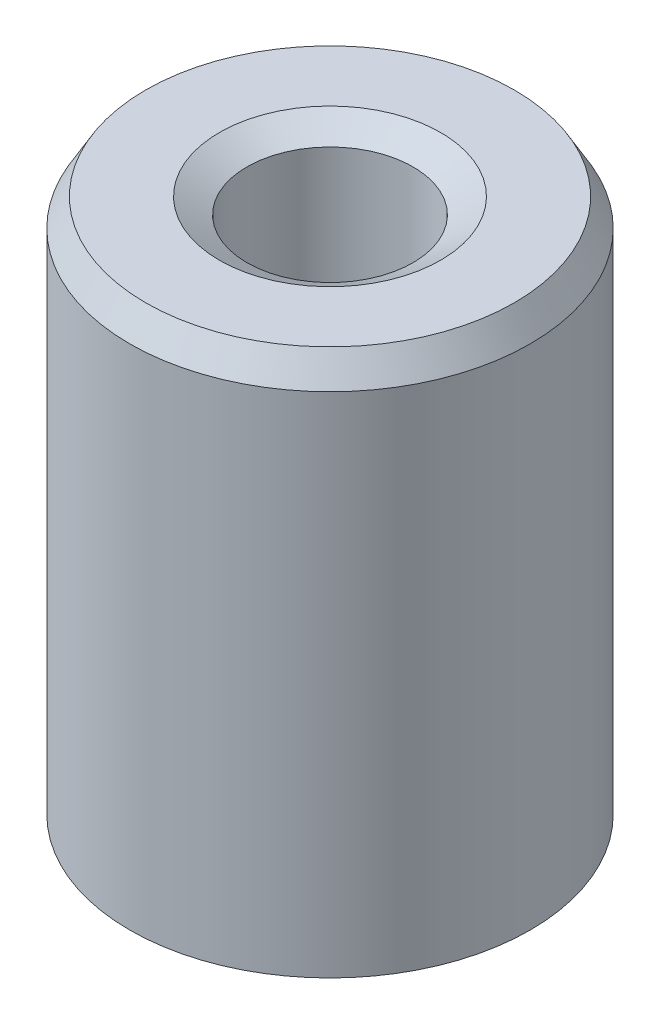
ISO-10303-21;
HEADER;
FILE_DESCRIPTION(('STEP AP214'),'2;1');
FILE_NAME('part.step','',(''),(''),'','','');
FILE_SCHEMA(('AUTOMOTIVE_DESIGN { 1 0 10303 214 1 1 1 1 }'));
ENDSEC;
DATA;
#1=APPLICATION_CONTEXT('core data for automotive mechanical design processes');
#2=APPLICATION_PROTOCOL_DEFINITION('international standard','automotive_design',2000,#1);
#3=PRODUCT_CONTEXT('',#1,'mechanical');
#4=PRODUCT('Part','Part','',(#3));
#5=PRODUCT_RELATED_PRODUCT_CATEGORY('part','',(#4));
#6=PRODUCT_DEFINITION_FORMATION('','',#4);
#7=PRODUCT_DEFINITION_CONTEXT('part definition',#1,'design');
#8=PRODUCT_DEFINITION('design','',#6,#7);
#9=PRODUCT_DEFINITION_SHAPE('','',#8);
#10=(LENGTH_UNIT() NAMED_UNIT(*) SI_UNIT(.MILLI.,.METRE.));
#11=(NAMED_UNIT(*) PLANE_ANGLE_UNIT() SI_UNIT($,.RADIAN.));
#12=(NAMED_UNIT(*) SI_UNIT($,.STERADIAN.) SOLID_ANGLE_UNIT());
#13=UNCERTAINTY_MEASURE_WITH_UNIT(LENGTH_MEASURE(1.E-05),#10,'distance_accuracy_value','');
#14=(GEOMETRIC_REPRESENTATION_CONTEXT(3) GLOBAL_UNCERTAINTY_ASSIGNED_CONTEXT((#13)) GLOBAL_UNIT_ASSIGNED_CONTEXT((#10,
#11,#12)) REPRESENTATION_CONTEXT('',''));
#15=CARTESIAN_POINT('',(0.,0.,0.));
#16=DIRECTION('',(0.,0.,1.));
#17=DIRECTION('',(1.,0.,0.));
#18=AXIS2_PLACEMENT_3D('',#15,#16,#17);
#19=CARTESIAN_POINT('',(0.,61.934558298846,0.));
#20=DIRECTION('',(0.,-1.,0.));
#21=DIRECTION('',(0.,0.,-1.));
#22=AXIS2_PLACEMENT_3D('',#19,#20,#21);
#23=CYLINDRICAL_SURFACE('',#22,22.5);
#24=CARTESIAN_POINT('',(0.,1.79041406598166,0.));
#25=DIRECTION('',(0.,1.,0.));
#26=DIRECTION('',(0.,0.,1.));
#27=AXIS2_PLACEMENT_3D('',#24,#25,#26);
#28=CIRCLE('',#27,22.5);
#29=CARTESIAN_POINT('',(0.,1.79041406598166,22.5));
#30=VERTEX_POINT('',#29);
#31=EDGE_CURVE('E10',#30,#30,#28,.T.);
#32=ORIENTED_EDGE('',*,*,#31,.T.);
#33=EDGE_LOOP('',(#32));
#34=FACE_BOUND('',#33,.T.);
#35=CARTESIAN_POINT('',(0.,58.8334701699797,0.));
#36=DIRECTION('',(0.,1.,0.));
#37=DIRECTION('',(0.,0.,1.));
#38=AXIS2_PLACEMENT_3D('',#35,#36,#37);
#39=CIRCLE('',#38,22.5);
#40=CARTESIAN_POINT('',(0.,58.8334701699797,-22.5));
#41=VERTEX_POINT('',#40);
#42=EDGE_CURVE('E50',#41,#41,#39,.F.);
#43=ORIENTED_EDGE('',*,*,#42,.T.);
#44=EDGE_LOOP('',(#43));
#45=FACE_BOUND('',#44,.T.);
#46=ADVANCED_FACE('F39',(#34,#45),#23,.T.);
#47=CARTESIAN_POINT('',(0.,61.934558298846,0.));
#48=DIRECTION('',(0.,1.,0.));
#49=DIRECTION('',(0.,0.,1.));
#50=AXIS2_PLACEMENT_3D('',#47,#48,#49);
#51=PLANE('',#50);
#52=CARTESIAN_POINT('',(0.,61.934558298846,0.));
#53=DIRECTION('',(0.,1.,0.));
#54=DIRECTION('',(0.,0.,1.));
#55=AXIS2_PLACEMENT_3D('',#52,#53,#54);
#56=CIRCLE('',#55,12.4328409515347);
#57=CARTESIAN_POINT('',(0.,61.934558298846,12.4328409515347));
#58=VERTEX_POINT('',#57);
#59=EDGE_CURVE('E58',#58,#58,#56,.F.);
#60=ORIENTED_EDGE('',*,*,#59,.T.);
#61=EDGE_LOOP('',(#60));
#62=FACE_BOUND('',#61,.T.);
#63=CARTESIAN_POINT('',(0.,61.934558298846,0.));
#64=DIRECTION('',(0.,1.,0.));
#65=DIRECTION('',(0.,0.,1.));
#66=AXIS2_PLACEMENT_3D('',#63,#64,#65);
#67=CIRCLE('',#66,20.7095859340183);
#68=CARTESIAN_POINT('',(0.,61.934558298846,-20.7095859340183));
#69=VERTEX_POINT('',#68);
#70=EDGE_CURVE('E61',#69,#69,#67,.T.);
#71=ORIENTED_EDGE('',*,*,#70,.T.);
#72=EDGE_LOOP('',(#71));
#73=FACE_BOUND('',#72,.T.);
#74=ADVANCED_FACE('F88',(#62,#73),#51,.T.);
#75=CARTESIAN_POINT('',(0.,0.,0.));
#76=DIRECTION('',(0.,1.,0.));
#77=DIRECTION('',(0.,0.,1.));
#78=AXIS2_PLACEMENT_3D('',#75,#76,#77);
#79=PLANE('',#78);
#80=CARTESIAN_POINT('',(0.,0.,0.));
#81=DIRECTION('',(0.,1.,0.));
#82=DIRECTION('',(0.,0.,1.));
#83=AXIS2_PLACEMENT_3D('',#80,#81,#82);
#84=CIRCLE('',#83,11.1221668886501);
#85=CARTESIAN_POINT('',(0.,0.,11.1221668886501));
#86=VERTEX_POINT('',#85);
#87=EDGE_CURVE('E51',#86,#86,#84,.T.);
#88=ORIENTED_EDGE('',*,*,#87,.T.);
#89=EDGE_LOOP('',(#88));
#90=FACE_BOUND('',#89,.T.);
#91=CARTESIAN_POINT('',(0.,0.,0.));
#92=DIRECTION('',(0.,1.,0.));
#93=DIRECTION('',(0.,0.,1.));
#94=AXIS2_PLACEMENT_3D('',#91,#92,#93);
#95=CIRCLE('',#94,19.3989118711337);
#96=CARTESIAN_POINT('',(0.,0.,19.3989118711337));
#97=VERTEX_POINT('',#96);
#98=EDGE_CURVE('E54',#97,#97,#95,.F.);
#99=ORIENTED_EDGE('',*,*,#98,.T.);
#100=EDGE_LOOP('',(#99));
#101=FACE_BOUND('',#100,.T.);
#102=ADVANCED_FACE('F83',(#90,#101),#79,.F.);
#103=CARTESIAN_POINT('',(0.,61.934558298846,0.));
#104=DIRECTION('',(0.,-1.,0.));
#105=DIRECTION('',(0.,0.,-1.));
#106=AXIS2_PLACEMENT_3D('',#103,#104,#105);
#107=CYLINDRICAL_SURFACE('',#106,9.33175282266846);
#108=CARTESIAN_POINT('',(0.,60.1441442328643,0.));
#109=DIRECTION('',(0.,1.,0.));
#110=DIRECTION('',(0.,0.,1.));
#111=AXIS2_PLACEMENT_3D('',#108,#109,#110);
#112=CIRCLE('',#111,9.33175282266846);
#113=CARTESIAN_POINT('',(0.,60.1441442328643,9.33175282266846));
#114=VERTEX_POINT('',#113);
#115=EDGE_CURVE('E67',#114,#114,#112,.T.);
#116=ORIENTED_EDGE('',*,*,#115,.T.);
#117=EDGE_LOOP('',(#116));
#118=FACE_BOUND('',#117,.T.);
#119=CARTESIAN_POINT('',(0.,3.1010881288662,0.));
#120=DIRECTION('',(0.,1.,0.));
#121=DIRECTION('',(0.,0.,1.));
#122=AXIS2_PLACEMENT_3D('',#119,#120,#121);
#123=CIRCLE('',#122,9.33175282266846);
#124=CARTESIAN_POINT('',(0.,3.1010881288662,9.33175282266846));
#125=VERTEX_POINT('',#124);
#126=EDGE_CURVE('E69',#125,#125,#123,.F.);
#127=ORIENTED_EDGE('',*,*,#126,.T.);
#128=EDGE_LOOP('',(#127));
#129=FACE_BOUND('',#128,.T.);
#130=ADVANCED_FACE('F71',(#118,#129),#107,.F.);
#131=CARTESIAN_POINT('',(0.,60.1441442328643,0.));
#132=DIRECTION('',(0.,1.,0.));
#133=DIRECTION('',(0.,0.,1.));
#134=AXIS2_PLACEMENT_3D('',#131,#132,#133);
#135=CONICAL_SURFACE('',#134,9.33175282266846,1.0471975511966);
#136=ORIENTED_EDGE('',*,*,#59,.F.);
#137=EDGE_LOOP('',(#136));
#138=FACE_BOUND('',#137,.T.);
#139=ORIENTED_EDGE('',*,*,#115,.F.);
#140=EDGE_LOOP('',(#139));
#141=FACE_BOUND('',#140,.T.);
#142=ADVANCED_FACE('F77',(#138,#141),#135,.F.);
#143=CARTESIAN_POINT('',(0.,0.,0.));
#144=DIRECTION('',(0.,-1.,0.));
#145=DIRECTION('',(0.,0.,-1.));
#146=AXIS2_PLACEMENT_3D('',#143,#144,#145);
#147=CONICAL_SURFACE('',#146,11.1221668886501,0.523598775598296);
#148=ORIENTED_EDGE('',*,*,#126,.F.);
#149=EDGE_LOOP('',(#148));
#150=FACE_BOUND('',#149,.T.);
#151=ORIENTED_EDGE('',*,*,#87,.F.);
#152=EDGE_LOOP('',(#151));
#153=FACE_BOUND('',#152,.T.);
#154=ADVANCED_FACE('F73',(#150,#153),#147,.F.);
#155=CARTESIAN_POINT('',(0.,1.79041406598166,0.));
#156=DIRECTION('',(0.,1.,0.));
#157=DIRECTION('',(0.,0.,1.));
#158=AXIS2_PLACEMENT_3D('',#155,#156,#157);
#159=CONICAL_SURFACE('',#158,22.5,1.0471975511966);
#160=ORIENTED_EDGE('',*,*,#98,.F.);
#161=EDGE_LOOP('',(#160));
#162=FACE_BOUND('',#161,.T.);
#163=ORIENTED_EDGE('',*,*,#31,.F.);
#164=EDGE_LOOP('',(#163));
#165=FACE_BOUND('',#164,.T.);
#166=ADVANCED_FACE('F76',(#162,#165),#159,.T.);
#167=CARTESIAN_POINT('',(0.,61.934558298846,0.));
#168=DIRECTION('',(0.,-1.,0.));
#169=DIRECTION('',(0.,0.,-1.));
#170=AXIS2_PLACEMENT_3D('',#167,#168,#169);
#171=CONICAL_SURFACE('',#170,20.7095859340183,0.523598775598295);
#172=CARTESIAN_POINT('',(0.,58.8334701699797,-22.5));
#173=CARTESIAN_POINT('',(0.,58.8657731713221,-22.4813498534794));
#174=CARTESIAN_POINT('',(0.,58.8980761726644,-22.4626997069587));
#175=CARTESIAN_POINT('',(0.,58.9626821753491,-22.4253994139174));
#176=CARTESIAN_POINT('',(0.,58.9949851766915,-22.4067492673968));
#177=CARTESIAN_POINT('',(0.,59.0595911793762,-22.3694489743555));
#178=CARTESIAN_POINT('',(0.,59.0918941807186,-22.3507988278349));
#179=CARTESIAN_POINT('',(0.,59.1565001834033,-22.3134985347936));
#180=CARTESIAN_POINT('',(0.,59.1888031847456,-22.2948483882729));
#181=CARTESIAN_POINT('',(0.,59.2534091874304,-22.2575480952317));
#182=CARTESIAN_POINT('',(0.,59.2857121887727,-22.238897948711));
#183=CARTESIAN_POINT('',(0.,59.3503181914574,-22.2015976556697));
#184=CARTESIAN_POINT('',(0.,59.3826211927998,-22.1829475091491));
#185=CARTESIAN_POINT('',(0.,59.4472271954845,-22.1456472161078));
#186=CARTESIAN_POINT('',(0.,59.4795301968269,-22.1269970695872));
#187=CARTESIAN_POINT('',(0.,59.5441361995116,-22.0896967765459));
#188=CARTESIAN_POINT('',(0.,59.5764392008539,-22.0710466300252));
#189=CARTESIAN_POINT('',(0.,59.6410452035386,-22.0337463369839));
#190=CARTESIAN_POINT('',(0.,59.673348204881,-22.0150961904633));
#191=CARTESIAN_POINT('',(0.,59.7379542075657,-21.977795897422));
#192=CARTESIAN_POINT('',(0.,59.7702572089081,-21.9591457509014));
#193=CARTESIAN_POINT('',(0.,59.8348632115928,-21.9218454578601));
#194=CARTESIAN_POINT('',(0.,59.8671662129351,-21.9031953113394));
#195=CARTESIAN_POINT('',(0.,59.9317722156199,-21.8658950182982));
#196=CARTESIAN_POINT('',(0.,59.9640752169622,-21.8472448717775));
#197=CARTESIAN_POINT('',(0.,60.0286812196469,-21.8099445787362));
#198=CARTESIAN_POINT('',(0.,60.0609842209893,-21.7912944322156));
#199=CARTESIAN_POINT('',(0.,60.125590223674,-21.7539941391743));
#200=CARTESIAN_POINT('',(0.,60.1578932250164,-21.7353439926537));
#201=CARTESIAN_POINT('',(0.,60.2224992277011,-21.6980436996124));
#202=CARTESIAN_POINT('',(0.,60.2548022290434,-21.6793935530917));
#203=CARTESIAN_POINT('',(0.,60.3194082317281,-21.6420932600505));
#204=CARTESIAN_POINT('',(0.,60.3517112330705,-21.6234431135298));
#205=CARTESIAN_POINT('',(0.,60.4163172357552,-21.5861428204885));
#206=CARTESIAN_POINT('',(0.,60.4486202370976,-21.5674926739679));
#207=CARTESIAN_POINT('',(0.,60.5132262397823,-21.5301923809266));
#208=CARTESIAN_POINT('',(0.,60.5455292411246,-21.511542234406));
#209=CARTESIAN_POINT('',(0.,60.6101352438093,-21.4742419413647));
#210=CARTESIAN_POINT('',(0.,60.6424382451517,-21.455591794844));
#211=CARTESIAN_POINT('',(0.,60.7070442478364,-21.4182915018027));
#212=CARTESIAN_POINT('',(0.,60.7393472491788,-21.3996413552821));
#213=CARTESIAN_POINT('',(0.,60.8039532518635,-21.3623410622408));
#214=CARTESIAN_POINT('',(0.,60.8362562532059,-21.3436909157202));
#215=CARTESIAN_POINT('',(0.,60.9008622558906,-21.3063906226789));
#216=CARTESIAN_POINT('',(0.,60.9331652572329,-21.2877404761582));
#217=CARTESIAN_POINT('',(0.,60.9977712599176,-21.250440183117));
#218=CARTESIAN_POINT('',(0.,61.03007426126,-21.2317900365963));
#219=CARTESIAN_POINT('',(0.,61.0946802639447,-21.194489743555));
#220=CARTESIAN_POINT('',(0.,61.1269832652871,-21.1758395970344));
#221=CARTESIAN_POINT('',(0.,61.1915892679718,-21.1385393039931));
#222=CARTESIAN_POINT('',(0.,61.2238922693141,-21.1198891574725));
#223=CARTESIAN_POINT('',(0.,61.2884982719988,-21.0825888644312));
#224=CARTESIAN_POINT('',(0.,61.3208012733412,-21.0639387179105));
#225=CARTESIAN_POINT('',(0.,61.3854072760259,-21.0266384248693));
#226=CARTESIAN_POINT('',(0.,61.4177102773683,-21.0079882783486));
#227=CARTESIAN_POINT('',(0.,61.482316280053,-20.9706879853073));
#228=CARTESIAN_POINT('',(0.,61.5146192813953,-20.9520378387867));
#229=CARTESIAN_POINT('',(0.,61.5792252840801,-20.9147375457454));
#230=CARTESIAN_POINT('',(0.,61.6115282854224,-20.8960873992248));
#231=CARTESIAN_POINT('',(0.,61.6761342881071,-20.8587871061835));
#232=CARTESIAN_POINT('',(0.,61.7084372894495,-20.8401369596628));
#233=CARTESIAN_POINT('',(0.,61.7730432921342,-20.8028366666215));
#234=CARTESIAN_POINT('',(0.,61.8053462934766,-20.7841865201009));
#235=CARTESIAN_POINT('',(0.,61.8699522961613,-20.7468862270596));
#236=CARTESIAN_POINT('',(0.,61.9022552975036,-20.728236080539));
#237=CARTESIAN_POINT('',(0.,61.934558298846,-20.7095859340183));
#238=B_SPLINE_CURVE_WITH_KNOTS('',3,(#172,#173,#174,#175,#176,#177,#178,#179,#180,#181,#182,
#183,#184,#185,#186,#187,#188,#189,#190,#191,#192,#193,#194,#195,#196,#197,#198,#199,#200,#201,
#202,#203,#204,#205,#206,#207,#208,#209,#210,#211,#212,#213,#214,#215,#216,#217,#218,#219,#220,
#221,#222,#223,#224,#225,#226,#227,#228,#229,#230,#231,#232,#233,#234,#235,#236,#237),
.UNSPECIFIED.,.F.,.F.,(4,2,2,2,2,2,2,2,2,2,2,2,2,2,2,2,2,2,2,2,2,2,2,2,2,2,2,2,2,2,2,2,4),(0.,
0.11190087912386,0.223801758247715,0.335702637371569,0.447603516495424,0.559504395619278,
0.671405274743133,0.783306153866993,0.895207032990848,1.0071079121147,1.11900879123856,
1.23090967036241,1.34281054948626,1.45471142861012,1.56661230773398,1.67851318685783,
1.79041406598169,1.90231494510554,2.0142158242294,2.12611670335325,2.23801758247711,
2.34991846160096,2.46181934072482,2.57372021984867,2.68562109897253,2.79752197809638,
2.90942285722024,3.0213237363441,3.13322461546795,3.2451254945918,3.35702637371566,
3.46892725283951,3.58082813196337),.UNSPECIFIED.);
#239=EDGE_CURVE('BSEAM45',#41,#69,#238,.T.);
#240=ORIENTED_EDGE('',*,*,#42,.F.);
#241=ORIENTED_EDGE('',*,*,#70,.F.);
#242=ORIENTED_EDGE('',*,*,#239,.T.);
#243=ORIENTED_EDGE('',*,*,#239,.F.);
#244=EDGE_LOOP('',(#240,#242,#241,#243));
#245=FACE_BOUND('',#244,.T.);
#246=ADVANCED_FACE('F45',(#245),#171,.T.);
#247=CLOSED_SHELL('',(#46,#74,#102,#130,#142,#154,#166,#246));
#248=MANIFOLD_SOLID_BREP('B2',#247);
#249=ADVANCED_BREP_SHAPE_REPRESENTATION('',(#18,#248),#14);
#250=SHAPE_DEFINITION_REPRESENTATION(#9,#249);
ENDSEC;
END-ISO-10303-21;
